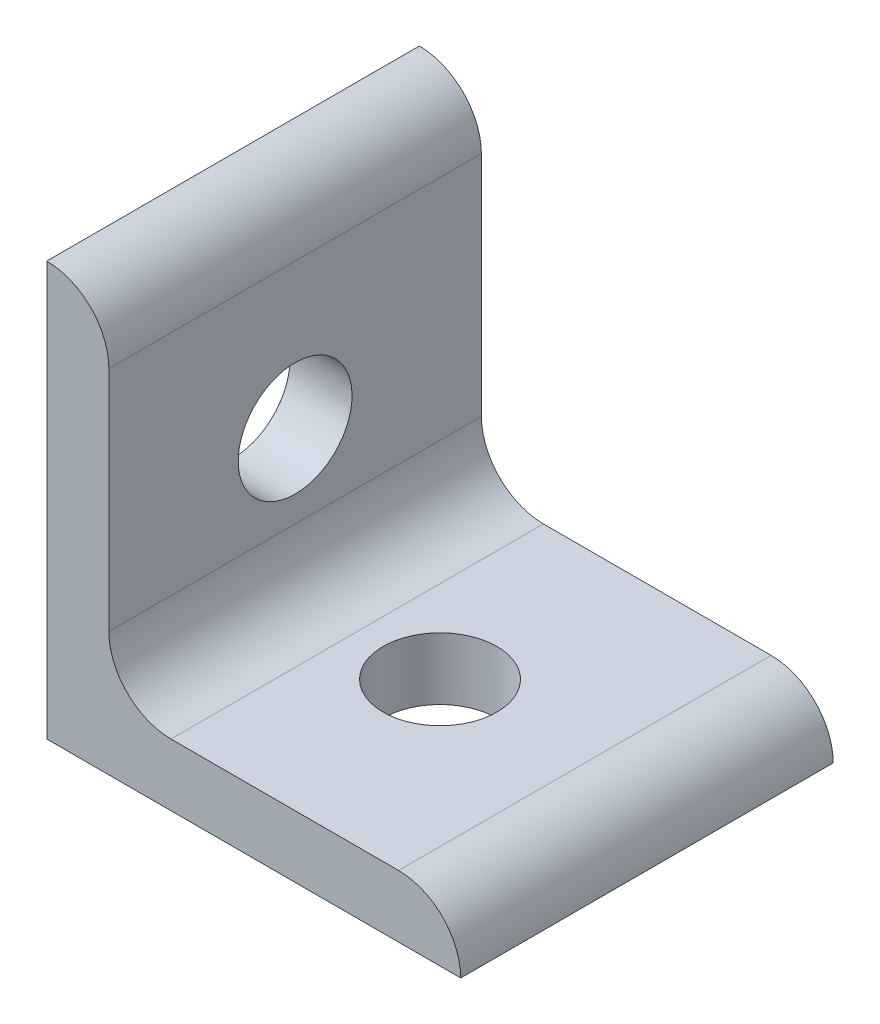
ISO-10303-21;
HEADER;
FILE_DESCRIPTION(('STEP AP214'),'2;1');
FILE_NAME('part.step','',(''),(''),'','','');
FILE_SCHEMA(('AUTOMOTIVE_DESIGN { 1 0 10303 214 1 1 1 1 }'));
ENDSEC;
DATA;
#1=APPLICATION_CONTEXT('core data for automotive mechanical design processes');
#2=APPLICATION_PROTOCOL_DEFINITION('international standard','automotive_design',2000,#1);
#3=PRODUCT_CONTEXT('',#1,'mechanical');
#4=PRODUCT('Part','Part','',(#3));
#5=PRODUCT_RELATED_PRODUCT_CATEGORY('part','',(#4));
#6=PRODUCT_DEFINITION_FORMATION('','',#4);
#7=PRODUCT_DEFINITION_CONTEXT('part definition',#1,'design');
#8=PRODUCT_DEFINITION('design','',#6,#7);
#9=PRODUCT_DEFINITION_SHAPE('','',#8);
#10=(LENGTH_UNIT() NAMED_UNIT(*) SI_UNIT(.MILLI.,.METRE.));
#11=(NAMED_UNIT(*) PLANE_ANGLE_UNIT() SI_UNIT($,.RADIAN.));
#12=(NAMED_UNIT(*) SI_UNIT($,.STERADIAN.) SOLID_ANGLE_UNIT());
#13=UNCERTAINTY_MEASURE_WITH_UNIT(LENGTH_MEASURE(1.E-05),#10,'distance_accuracy_value','');
#14=(GEOMETRIC_REPRESENTATION_CONTEXT(3) GLOBAL_UNCERTAINTY_ASSIGNED_CONTEXT((#13)) GLOBAL_UNIT_ASSIGNED_CONTEXT((#10,
#11,#12)) REPRESENTATION_CONTEXT('',''));
#15=CARTESIAN_POINT('',(0.,0.,0.));
#16=DIRECTION('',(0.,0.,1.));
#17=DIRECTION('',(1.,0.,0.));
#18=AXIS2_PLACEMENT_3D('',#15,#16,#17);
#19=CARTESIAN_POINT('',(3.,17.,9.));
#20=DIRECTION('',(-1.,0.,0.));
#21=DIRECTION('',(0.,-1.,0.));
#22=AXIS2_PLACEMENT_3D('',#19,#20,#21);
#23=PLANE('',#22);
#24=DIRECTION('',(0.,1.,0.));
#25=VECTOR('',#24,1.);
#26=CARTESIAN_POINT('',(3.,17.,-9.));
#27=LINE('',#26,#25);
#28=CARTESIAN_POINT('',(3.,6.,-9.));
#29=VERTEX_POINT('',#28);
#30=CARTESIAN_POINT('',(3.,17.,-9.));
#31=VERTEX_POINT('',#30);
#32=EDGE_CURVE('E140',#29,#31,#27,.T.);
#33=ORIENTED_EDGE('',*,*,#32,.T.);
#34=DIRECTION('',(0.,0.,-1.));
#35=VECTOR('',#34,1.);
#36=CARTESIAN_POINT('',(3.,17.,9.));
#37=LINE('',#36,#35);
#38=CARTESIAN_POINT('',(3.,17.,9.));
#39=VERTEX_POINT('',#38);
#40=EDGE_CURVE('E137',#39,#31,#37,.T.);
#41=ORIENTED_EDGE('',*,*,#40,.F.);
#42=DIRECTION('',(0.,1.,0.));
#43=VECTOR('',#42,1.);
#44=CARTESIAN_POINT('',(3.,17.,9.));
#45=LINE('',#44,#43);
#46=CARTESIAN_POINT('',(3.,6.,9.));
#47=VERTEX_POINT('',#46);
#48=EDGE_CURVE('E125',#47,#39,#45,.T.);
#49=ORIENTED_EDGE('',*,*,#48,.F.);
#50=DIRECTION('',(0.,0.,-1.));
#51=VECTOR('',#50,1.);
#52=CARTESIAN_POINT('',(3.,6.,9.));
#53=LINE('',#52,#51);
#54=EDGE_CURVE('E142',#47,#29,#53,.T.);
#55=ORIENTED_EDGE('',*,*,#54,.T.);
#56=EDGE_LOOP('',(#33,#41,#49,#55));
#57=FACE_BOUND('',#56,.T.);
#58=CARTESIAN_POINT('',(3.,10.,0.));
#59=DIRECTION('',(-1.,0.,0.));
#60=DIRECTION('',(0.,-1.,0.));
#61=AXIS2_PLACEMENT_3D('',#58,#59,#60);
#62=CIRCLE('',#61,2.75);
#63=CARTESIAN_POINT('',(3.,7.25000000000001,0.));
#64=VERTEX_POINT('',#63);
#65=EDGE_CURVE('E212',#64,#64,#62,.F.);
#66=ORIENTED_EDGE('',*,*,#65,.F.);
#67=EDGE_LOOP('',(#66));
#68=FACE_BOUND('',#67,.T.);
#69=ADVANCED_FACE('F43',(#57,#68),#23,.F.);
#70=CARTESIAN_POINT('',(0.,0.,9.));
#71=DIRECTION('',(1.,0.,0.));
#72=DIRECTION('',(0.,0.,-1.));
#73=AXIS2_PLACEMENT_3D('',#70,#71,#72);
#74=PLANE('',#73);
#75=DIRECTION('',(0.,-1.,0.));
#76=VECTOR('',#75,1.);
#77=CARTESIAN_POINT('',(0.,0.,-9.));
#78=LINE('',#77,#76);
#79=CARTESIAN_POINT('',(0.,20.,-9.));
#80=VERTEX_POINT('',#79);
#81=CARTESIAN_POINT('',(0.,0.,-9.));
#82=VERTEX_POINT('',#81);
#83=EDGE_CURVE('E103',#80,#82,#78,.T.);
#84=ORIENTED_EDGE('',*,*,#83,.T.);
#85=DIRECTION('',(0.,0.,-1.));
#86=VECTOR('',#85,1.);
#87=CARTESIAN_POINT('',(0.,0.,9.));
#88=LINE('',#87,#86);
#89=CARTESIAN_POINT('',(0.,0.,9.));
#90=VERTEX_POINT('',#89);
#91=EDGE_CURVE('E149',#90,#82,#88,.T.);
#92=ORIENTED_EDGE('',*,*,#91,.F.);
#93=DIRECTION('',(0.,-1.,0.));
#94=VECTOR('',#93,1.);
#95=CARTESIAN_POINT('',(0.,0.,9.));
#96=LINE('',#95,#94);
#97=CARTESIAN_POINT('',(0.,20.,9.));
#98=VERTEX_POINT('',#97);
#99=EDGE_CURVE('E65',#98,#90,#96,.T.);
#100=ORIENTED_EDGE('',*,*,#99,.F.);
#101=DIRECTION('',(0.,0.,-1.));
#102=VECTOR('',#101,1.);
#103=CARTESIAN_POINT('',(0.,20.,9.));
#104=LINE('',#103,#102);
#105=EDGE_CURVE('E143',#98,#80,#104,.T.);
#106=ORIENTED_EDGE('',*,*,#105,.T.);
#107=EDGE_LOOP('',(#84,#92,#100,#106));
#108=FACE_BOUND('',#107,.T.);
#109=CARTESIAN_POINT('',(0.,10.,0.));
#110=DIRECTION('',(1.,0.,0.));
#111=DIRECTION('',(0.,0.,-1.));
#112=AXIS2_PLACEMENT_3D('',#109,#110,#111);
#113=CIRCLE('',#112,2.75);
#114=CARTESIAN_POINT('',(0.,10.,-2.75));
#115=VERTEX_POINT('',#114);
#116=EDGE_CURVE('E215',#115,#115,#113,.T.);
#117=ORIENTED_EDGE('',*,*,#116,.T.);
#118=EDGE_LOOP('',(#117));
#119=FACE_BOUND('',#118,.T.);
#120=ADVANCED_FACE('F220',(#108,#119),#74,.F.);
#121=CARTESIAN_POINT('',(20.,0.,9.));
#122=DIRECTION('',(0.,1.,0.));
#123=DIRECTION('',(-1.,0.,0.));
#124=AXIS2_PLACEMENT_3D('',#121,#122,#123);
#125=PLANE('',#124);
#126=DIRECTION('',(1.,0.,0.));
#127=VECTOR('',#126,1.);
#128=CARTESIAN_POINT('',(20.,0.,-9.));
#129=LINE('',#128,#127);
#130=CARTESIAN_POINT('',(20.,0.,-9.));
#131=VERTEX_POINT('',#130);
#132=EDGE_CURVE('E153',#82,#131,#129,.T.);
#133=ORIENTED_EDGE('',*,*,#132,.T.);
#134=DIRECTION('',(0.,0.,-1.));
#135=VECTOR('',#134,1.);
#136=CARTESIAN_POINT('',(20.,0.,9.));
#137=LINE('',#136,#135);
#138=CARTESIAN_POINT('',(20.,0.,9.));
#139=VERTEX_POINT('',#138);
#140=EDGE_CURVE('E11',#139,#131,#137,.T.);
#141=ORIENTED_EDGE('',*,*,#140,.F.);
#142=DIRECTION('',(1.,0.,0.));
#143=VECTOR('',#142,1.);
#144=CARTESIAN_POINT('',(20.,0.,9.));
#145=LINE('',#144,#143);
#146=EDGE_CURVE('E172',#90,#139,#145,.T.);
#147=ORIENTED_EDGE('',*,*,#146,.F.);
#148=ORIENTED_EDGE('',*,*,#91,.T.);
#149=EDGE_LOOP('',(#133,#141,#147,#148));
#150=FACE_BOUND('',#149,.T.);
#151=CARTESIAN_POINT('',(10.,0.,0.));
#152=DIRECTION('',(0.,1.,0.));
#153=DIRECTION('',(0.,0.,1.));
#154=AXIS2_PLACEMENT_3D('',#151,#152,#153);
#155=CIRCLE('',#154,2.75);
#156=CARTESIAN_POINT('',(10.,0.,2.75));
#157=VERTEX_POINT('',#156);
#158=EDGE_CURVE('E208',#157,#157,#155,.T.);
#159=ORIENTED_EDGE('',*,*,#158,.T.);
#160=EDGE_LOOP('',(#159));
#161=FACE_BOUND('',#160,.T.);
#162=ADVANCED_FACE('F45',(#150,#161),#125,.F.);
#163=CARTESIAN_POINT('',(6.,3.,9.));
#164=DIRECTION('',(0.,-1.,0.));
#165=DIRECTION('',(1.,0.,0.));
#166=AXIS2_PLACEMENT_3D('',#163,#164,#165);
#167=PLANE('',#166);
#168=DIRECTION('',(-1.,0.,0.));
#169=VECTOR('',#168,1.);
#170=CARTESIAN_POINT('',(6.,3.,-9.));
#171=LINE('',#170,#169);
#172=CARTESIAN_POINT('',(17.,3.,-9.));
#173=VERTEX_POINT('',#172);
#174=CARTESIAN_POINT('',(6.,3.,-9.));
#175=VERTEX_POINT('',#174);
#176=EDGE_CURVE('E160',#173,#175,#171,.T.);
#177=ORIENTED_EDGE('',*,*,#176,.T.);
#178=DIRECTION('',(0.,0.,-1.));
#179=VECTOR('',#178,1.);
#180=CARTESIAN_POINT('',(6.,3.,9.));
#181=LINE('',#180,#179);
#182=CARTESIAN_POINT('',(6.,3.,9.));
#183=VERTEX_POINT('',#182);
#184=EDGE_CURVE('E179',#183,#175,#181,.T.);
#185=ORIENTED_EDGE('',*,*,#184,.F.);
#186=DIRECTION('',(-1.,0.,0.));
#187=VECTOR('',#186,1.);
#188=CARTESIAN_POINT('',(6.,3.,9.));
#189=LINE('',#188,#187);
#190=CARTESIAN_POINT('',(17.,3.,9.));
#191=VERTEX_POINT('',#190);
#192=EDGE_CURVE('E192',#191,#183,#189,.T.);
#193=ORIENTED_EDGE('',*,*,#192,.F.);
#194=DIRECTION('',(0.,0.,-1.));
#195=VECTOR('',#194,1.);
#196=CARTESIAN_POINT('',(17.,3.,9.));
#197=LINE('',#196,#195);
#198=EDGE_CURVE('E54',#191,#173,#197,.T.);
#199=ORIENTED_EDGE('',*,*,#198,.T.);
#200=EDGE_LOOP('',(#177,#185,#193,#199));
#201=FACE_BOUND('',#200,.T.);
#202=CARTESIAN_POINT('',(10.,3.,0.));
#203=DIRECTION('',(0.,-1.,0.));
#204=DIRECTION('',(1.,0.,0.));
#205=AXIS2_PLACEMENT_3D('',#202,#203,#204);
#206=CIRCLE('',#205,2.75);
#207=CARTESIAN_POINT('',(12.75,3.,0.));
#208=VERTEX_POINT('',#207);
#209=EDGE_CURVE('E47',#208,#208,#206,.F.);
#210=ORIENTED_EDGE('',*,*,#209,.F.);
#211=EDGE_LOOP('',(#210));
#212=FACE_BOUND('',#211,.T.);
#213=ADVANCED_FACE('F189',(#201,#212),#167,.F.);
#214=CARTESIAN_POINT('',(17.,0.,9.));
#215=DIRECTION('',(0.,0.,-1.));
#216=DIRECTION('',(-1.,0.,0.));
#217=AXIS2_PLACEMENT_3D('',#214,#215,#216);
#218=CYLINDRICAL_SURFACE('',#217,3.);
#219=CARTESIAN_POINT('',(17.,0.,-9.));
#220=DIRECTION('',(0.,0.,1.));
#221=DIRECTION('',(1.,0.,0.));
#222=AXIS2_PLACEMENT_3D('',#219,#220,#221);
#223=CIRCLE('',#222,3.);
#224=EDGE_CURVE('E157',#131,#173,#223,.T.);
#225=ORIENTED_EDGE('',*,*,#224,.T.);
#226=ORIENTED_EDGE('',*,*,#198,.F.);
#227=CARTESIAN_POINT('',(17.,0.,9.));
#228=DIRECTION('',(0.,0.,1.));
#229=DIRECTION('',(1.,0.,0.));
#230=AXIS2_PLACEMENT_3D('',#227,#228,#229);
#231=CIRCLE('',#230,3.);
#232=EDGE_CURVE('E113',#139,#191,#231,.T.);
#233=ORIENTED_EDGE('',*,*,#232,.F.);
#234=ORIENTED_EDGE('',*,*,#140,.T.);
#235=EDGE_LOOP('',(#225,#226,#233,#234));
#236=FACE_BOUND('',#235,.T.);
#237=ADVANCED_FACE('F238',(#236),#218,.T.);
#238=CARTESIAN_POINT('',(6.,6.,9.));
#239=DIRECTION('',(0.,0.,-1.));
#240=DIRECTION('',(-1.,0.,0.));
#241=AXIS2_PLACEMENT_3D('',#238,#239,#240);
#242=CYLINDRICAL_SURFACE('',#241,3.);
#243=CARTESIAN_POINT('',(6.,6.,-9.));
#244=DIRECTION('',(0.,0.,-1.));
#245=DIRECTION('',(1.,0.,0.));
#246=AXIS2_PLACEMENT_3D('',#243,#244,#245);
#247=CIRCLE('',#246,3.);
#248=EDGE_CURVE('E163',#175,#29,#247,.T.);
#249=ORIENTED_EDGE('',*,*,#248,.T.);
#250=ORIENTED_EDGE('',*,*,#54,.F.);
#251=CARTESIAN_POINT('',(6.,6.,9.));
#252=DIRECTION('',(0.,0.,-1.));
#253=DIRECTION('',(1.,0.,0.));
#254=AXIS2_PLACEMENT_3D('',#251,#252,#253);
#255=CIRCLE('',#254,3.);
#256=EDGE_CURVE('E131',#183,#47,#255,.T.);
#257=ORIENTED_EDGE('',*,*,#256,.F.);
#258=ORIENTED_EDGE('',*,*,#184,.T.);
#259=EDGE_LOOP('',(#249,#250,#257,#258));
#260=FACE_BOUND('',#259,.T.);
#261=ADVANCED_FACE('F198',(#260),#242,.F.);
#262=CARTESIAN_POINT('',(0.,17.,9.));
#263=DIRECTION('',(0.,0.,-1.));
#264=DIRECTION('',(-1.,0.,0.));
#265=AXIS2_PLACEMENT_3D('',#262,#263,#264);
#266=CYLINDRICAL_SURFACE('',#265,3.);
#267=CARTESIAN_POINT('',(0.,17.,-9.));
#268=DIRECTION('',(0.,0.,1.));
#269=DIRECTION('',(1.,0.,0.));
#270=AXIS2_PLACEMENT_3D('',#267,#268,#269);
#271=CIRCLE('',#270,3.);
#272=EDGE_CURVE('E96',#31,#80,#271,.T.);
#273=ORIENTED_EDGE('',*,*,#272,.T.);
#274=ORIENTED_EDGE('',*,*,#105,.F.);
#275=CARTESIAN_POINT('',(0.,17.,9.));
#276=DIRECTION('',(0.,0.,1.));
#277=DIRECTION('',(1.,0.,0.));
#278=AXIS2_PLACEMENT_3D('',#275,#276,#277);
#279=CIRCLE('',#278,3.);
#280=EDGE_CURVE('E129',#39,#98,#279,.T.);
#281=ORIENTED_EDGE('',*,*,#280,.F.);
#282=ORIENTED_EDGE('',*,*,#40,.T.);
#283=EDGE_LOOP('',(#273,#274,#281,#282));
#284=FACE_BOUND('',#283,.T.);
#285=ADVANCED_FACE('F145',(#284),#266,.T.);
#286=CARTESIAN_POINT('',(0.,17.,9.));
#287=DIRECTION('',(0.,0.,1.));
#288=DIRECTION('',(1.,0.,0.));
#289=AXIS2_PLACEMENT_3D('',#286,#287,#288);
#290=PLANE('',#289);
#291=ORIENTED_EDGE('',*,*,#146,.T.);
#292=ORIENTED_EDGE('',*,*,#232,.T.);
#293=ORIENTED_EDGE('',*,*,#192,.T.);
#294=ORIENTED_EDGE('',*,*,#256,.T.);
#295=ORIENTED_EDGE('',*,*,#48,.T.);
#296=ORIENTED_EDGE('',*,*,#280,.T.);
#297=ORIENTED_EDGE('',*,*,#99,.T.);
#298=EDGE_LOOP('',(#291,#292,#293,#294,#295,#296,#297));
#299=FACE_BOUND('',#298,.T.);
#300=ADVANCED_FACE('F127',(#299),#290,.T.);
#301=CARTESIAN_POINT('',(0.,17.,-9.));
#302=DIRECTION('',(0.,0.,1.));
#303=DIRECTION('',(1.,0.,0.));
#304=AXIS2_PLACEMENT_3D('',#301,#302,#303);
#305=PLANE('',#304);
#306=ORIENTED_EDGE('',*,*,#132,.F.);
#307=ORIENTED_EDGE('',*,*,#83,.F.);
#308=ORIENTED_EDGE('',*,*,#272,.F.);
#309=ORIENTED_EDGE('',*,*,#32,.F.);
#310=ORIENTED_EDGE('',*,*,#248,.F.);
#311=ORIENTED_EDGE('',*,*,#176,.F.);
#312=ORIENTED_EDGE('',*,*,#224,.F.);
#313=EDGE_LOOP('',(#306,#307,#308,#309,#310,#311,#312));
#314=FACE_BOUND('',#313,.T.);
#315=ADVANCED_FACE('F196',(#314),#305,.F.);
#316=CARTESIAN_POINT('',(10.,20.,0.));
#317=DIRECTION('',(0.,-1.,0.));
#318=DIRECTION('',(0.,0.,-1.));
#319=AXIS2_PLACEMENT_3D('',#316,#317,#318);
#320=CYLINDRICAL_SURFACE('',#319,2.75);
#321=ORIENTED_EDGE('',*,*,#158,.F.);
#322=EDGE_LOOP('',(#321));
#323=FACE_BOUND('',#322,.T.);
#324=ORIENTED_EDGE('',*,*,#209,.T.);
#325=EDGE_LOOP('',(#324));
#326=FACE_BOUND('',#325,.T.);
#327=ADVANCED_FACE('F225',(#323,#326),#320,.F.);
#328=CARTESIAN_POINT('',(20.,10.,0.));
#329=DIRECTION('',(-1.,0.,0.));
#330=DIRECTION('',(0.,0.,1.));
#331=AXIS2_PLACEMENT_3D('',#328,#329,#330);
#332=CYLINDRICAL_SURFACE('',#331,2.75);
#333=ORIENTED_EDGE('',*,*,#116,.F.);
#334=EDGE_LOOP('',(#333));
#335=FACE_BOUND('',#334,.T.);
#336=ORIENTED_EDGE('',*,*,#65,.T.);
#337=EDGE_LOOP('',(#336));
#338=FACE_BOUND('',#337,.T.);
#339=ADVANCED_FACE('F222',(#335,#338),#332,.F.);
#340=CLOSED_SHELL('',(#69,#120,#162,#213,#237,#261,#285,#300,#315,#327,#339));
#341=MANIFOLD_SOLID_BREP('B2',#340);
#342=ADVANCED_BREP_SHAPE_REPRESENTATION('',(#18,#341),#14);
#343=SHAPE_DEFINITION_REPRESENTATION(#9,#342);
ENDSEC;
END-ISO-10303-21;
